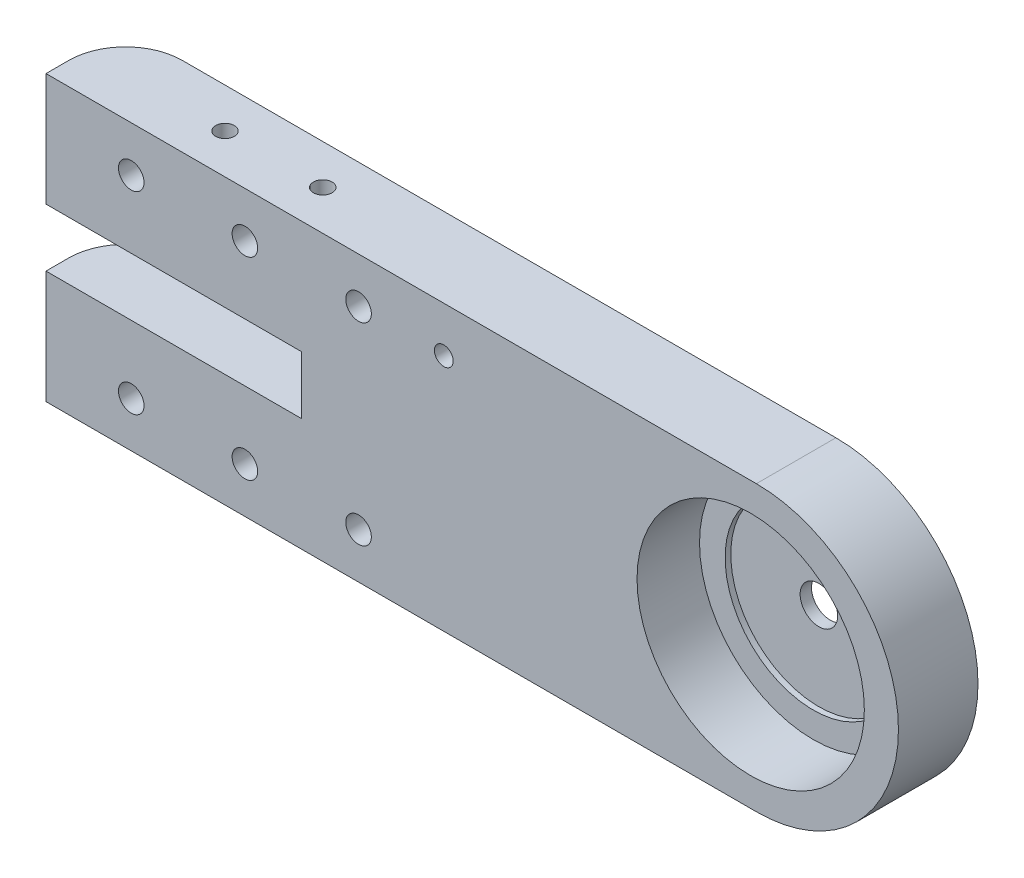
ISO-10303-21;
HEADER;
FILE_DESCRIPTION(('STEP AP214'),'2;1');
FILE_NAME('part.step','',(''),(''),'','','');
FILE_SCHEMA(('AUTOMOTIVE_DESIGN { 1 0 10303 214 1 1 1 1 }'));
ENDSEC;
DATA;
#1=APPLICATION_CONTEXT('core data for automotive mechanical design processes');
#2=APPLICATION_PROTOCOL_DEFINITION('international standard','automotive_design',2000,#1);
#3=PRODUCT_CONTEXT('',#1,'mechanical');
#4=PRODUCT('Part','Part','',(#3));
#5=PRODUCT_RELATED_PRODUCT_CATEGORY('part','',(#4));
#6=PRODUCT_DEFINITION_FORMATION('','',#4);
#7=PRODUCT_DEFINITION_CONTEXT('part definition',#1,'design');
#8=PRODUCT_DEFINITION('design','',#6,#7);
#9=PRODUCT_DEFINITION_SHAPE('','',#8);
#10=(LENGTH_UNIT() NAMED_UNIT(*) SI_UNIT(.MILLI.,.METRE.));
#11=(NAMED_UNIT(*) PLANE_ANGLE_UNIT() SI_UNIT($,.RADIAN.));
#12=(NAMED_UNIT(*) SI_UNIT($,.STERADIAN.) SOLID_ANGLE_UNIT());
#13=UNCERTAINTY_MEASURE_WITH_UNIT(LENGTH_MEASURE(1.E-05),#10,'distance_accuracy_value','');
#14=(GEOMETRIC_REPRESENTATION_CONTEXT(3) GLOBAL_UNCERTAINTY_ASSIGNED_CONTEXT((#13)) GLOBAL_UNIT_ASSIGNED_CONTEXT((#10,
#11,#12)) REPRESENTATION_CONTEXT('',''));
#15=CARTESIAN_POINT('',(0.,0.,0.));
#16=DIRECTION('',(0.,0.,1.));
#17=DIRECTION('',(1.,0.,0.));
#18=AXIS2_PLACEMENT_3D('',#15,#16,#17);
#19=CARTESIAN_POINT('',(0.,0.,0.));
#20=DIRECTION('',(-1.,0.,0.));
#21=DIRECTION('',(0.,-1.,0.));
#22=AXIS2_PLACEMENT_3D('',#19,#20,#21);
#23=PLANE('',#22);
#24=DIRECTION('',(0.,0.,-1.));
#25=VECTOR('',#24,1.);
#26=CARTESIAN_POINT('',(0.,-30.0999999994651,14.));
#27=LINE('',#26,#25);
#28=CARTESIAN_POINT('',(0.,-30.0999999994651,14.));
#29=VERTEX_POINT('',#28);
#30=CARTESIAN_POINT('',(0.,-30.0999999994651,10.));
#31=VERTEX_POINT('',#30);
#32=EDGE_CURVE('E109',#29,#31,#27,.T.);
#33=ORIENTED_EDGE('',*,*,#32,.T.);
#34=DIRECTION('',(0.,-1.,0.));
#35=VECTOR('',#34,1.);
#36=CARTESIAN_POINT('',(0.,-50.,10.));
#37=LINE('',#36,#35);
#38=CARTESIAN_POINT('',(0.,-50.,10.));
#39=VERTEX_POINT('',#38);
#40=EDGE_CURVE('E192',#31,#39,#37,.T.);
#41=ORIENTED_EDGE('',*,*,#40,.T.);
#42=DIRECTION('',(0.,0.,1.));
#43=VECTOR('',#42,1.);
#44=CARTESIAN_POINT('',(0.,-50.,0.));
#45=LINE('',#44,#43);
#46=CARTESIAN_POINT('',(0.,-50.,14.));
#47=VERTEX_POINT('',#46);
#48=EDGE_CURVE('E135',#39,#47,#45,.T.);
#49=ORIENTED_EDGE('',*,*,#48,.T.);
#50=DIRECTION('',(0.,-1.,0.));
#51=VECTOR('',#50,1.);
#52=CARTESIAN_POINT('',(0.,0.,14.));
#53=LINE('',#52,#51);
#54=EDGE_CURVE('E128',#29,#47,#53,.T.);
#55=ORIENTED_EDGE('',*,*,#54,.F.);
#56=EDGE_LOOP('',(#33,#41,#49,#55));
#57=FACE_BOUND('',#56,.T.);
#58=ADVANCED_FACE('F33',(#57),#23,.T.);
#59=CARTESIAN_POINT('',(125.,-25.,0.));
#60=DIRECTION('',(0.,0.,1.));
#61=DIRECTION('',(1.,0.,0.));
#62=AXIS2_PLACEMENT_3D('',#59,#60,#61);
#63=CYLINDRICAL_SURFACE('',#62,25.);
#64=CARTESIAN_POINT('',(125.,-25.,14.));
#65=DIRECTION('',(0.,0.,1.));
#66=DIRECTION('',(1.,0.,0.));
#67=AXIS2_PLACEMENT_3D('',#64,#65,#66);
#68=CIRCLE('',#67,25.);
#69=CARTESIAN_POINT('',(125.,-50.,14.));
#70=VERTEX_POINT('',#69);
#71=CARTESIAN_POINT('',(125.,0.,14.));
#72=VERTEX_POINT('',#71);
#73=EDGE_CURVE('E142',#70,#72,#68,.T.);
#74=ORIENTED_EDGE('',*,*,#73,.F.);
#75=DIRECTION('',(0.,0.,1.));
#76=VECTOR('',#75,1.);
#77=CARTESIAN_POINT('',(125.,-50.,0.));
#78=LINE('',#77,#76);
#79=CARTESIAN_POINT('',(125.,-50.,0.));
#80=VERTEX_POINT('',#79);
#81=EDGE_CURVE('E148',#80,#70,#78,.T.);
#82=ORIENTED_EDGE('',*,*,#81,.F.);
#83=CARTESIAN_POINT('',(125.,-25.,0.));
#84=DIRECTION('',(0.,0.,1.));
#85=DIRECTION('',(1.,0.,0.));
#86=AXIS2_PLACEMENT_3D('',#83,#84,#85);
#87=CIRCLE('',#86,25.);
#88=CARTESIAN_POINT('',(125.,0.,0.));
#89=VERTEX_POINT('',#88);
#90=EDGE_CURVE('E147',#80,#89,#87,.T.);
#91=ORIENTED_EDGE('',*,*,#90,.T.);
#92=DIRECTION('',(0.,0.,1.));
#93=VECTOR('',#92,1.);
#94=CARTESIAN_POINT('',(125.,0.,0.));
#95=LINE('',#94,#93);
#96=EDGE_CURVE('E154',#89,#72,#95,.T.);
#97=ORIENTED_EDGE('',*,*,#96,.T.);
#98=EDGE_LOOP('',(#74,#82,#91,#97));
#99=FACE_BOUND('',#98,.T.);
#100=ADVANCED_FACE('F317',(#99),#63,.T.);
#101=CARTESIAN_POINT('',(0.,-50.,0.));
#102=DIRECTION('',(0.,-1.,0.));
#103=DIRECTION('',(0.,0.,-1.));
#104=AXIS2_PLACEMENT_3D('',#101,#102,#103);
#105=PLANE('',#104);
#106=ORIENTED_EDGE('',*,*,#48,.F.);
#107=CARTESIAN_POINT('',(10.,-50.,10.));
#108=DIRECTION('',(0.,-1.,0.));
#109=DIRECTION('',(0.,0.,-1.));
#110=AXIS2_PLACEMENT_3D('',#107,#108,#109);
#111=CIRCLE('',#110,10.);
#112=CARTESIAN_POINT('',(10.,-50.,0.));
#113=VERTEX_POINT('',#112);
#114=EDGE_CURVE('E194',#39,#113,#111,.T.);
#115=ORIENTED_EDGE('',*,*,#114,.T.);
#116=DIRECTION('',(1.,0.,0.));
#117=VECTOR('',#116,1.);
#118=CARTESIAN_POINT('',(0.,-50.,0.));
#119=LINE('',#118,#117);
#120=EDGE_CURVE('E156',#113,#80,#119,.T.);
#121=ORIENTED_EDGE('',*,*,#120,.T.);
#122=ORIENTED_EDGE('',*,*,#81,.T.);
#123=DIRECTION('',(1.,0.,0.));
#124=VECTOR('',#123,1.);
#125=CARTESIAN_POINT('',(0.,-50.,14.));
#126=LINE('',#125,#124);
#127=EDGE_CURVE('E140',#47,#70,#126,.T.);
#128=ORIENTED_EDGE('',*,*,#127,.F.);
#129=EDGE_LOOP('',(#106,#115,#121,#122,#128));
#130=FACE_BOUND('',#129,.T.);
#131=ADVANCED_FACE('F322',(#130),#105,.T.);
#132=DIRECTION('',(0.,0.,1.));
#133=VECTOR('',#132,1.);
#134=CARTESIAN_POINT('',(0.,0.,0.));
#135=LINE('',#134,#133);
#136=CARTESIAN_POINT('',(0.,0.,10.));
#137=VERTEX_POINT('',#136);
#138=CARTESIAN_POINT('',(0.,0.,14.));
#139=VERTEX_POINT('',#138);
#140=EDGE_CURVE('E152',#137,#139,#135,.T.);
#141=ORIENTED_EDGE('',*,*,#140,.F.);
#142=DIRECTION('',(0.,-1.,0.));
#143=VECTOR('',#142,1.);
#144=CARTESIAN_POINT('',(0.,-19.8999999994651,10.));
#145=LINE('',#144,#143);
#146=CARTESIAN_POINT('',(0.,-19.8999999994651,10.));
#147=VERTEX_POINT('',#146);
#148=EDGE_CURVE('E201',#137,#147,#145,.T.);
#149=ORIENTED_EDGE('',*,*,#148,.T.);
#150=DIRECTION('',(0.,0.,-1.));
#151=VECTOR('',#150,1.);
#152=CARTESIAN_POINT('',(0.,-19.8999999994651,14.));
#153=LINE('',#152,#151);
#154=CARTESIAN_POINT('',(0.,-19.8999999994651,14.));
#155=VERTEX_POINT('',#154);
#156=EDGE_CURVE('E121',#155,#147,#153,.T.);
#157=ORIENTED_EDGE('',*,*,#156,.F.);
#158=EDGE_CURVE('E136',#139,#155,#53,.T.);
#159=ORIENTED_EDGE('',*,*,#158,.F.);
#160=EDGE_LOOP('',(#141,#149,#157,#159));
#161=FACE_BOUND('',#160,.T.);
#162=ADVANCED_FACE('F220',(#161),#23,.T.);
#163=CARTESIAN_POINT('',(125.,0.,0.));
#164=DIRECTION('',(0.,1.,0.));
#165=DIRECTION('',(0.,0.,1.));
#166=AXIS2_PLACEMENT_3D('',#163,#164,#165);
#167=PLANE('',#166);
#168=CARTESIAN_POINT('',(24.5,0.,7.00000000000001));
#169=DIRECTION('',(0.,1.,0.));
#170=DIRECTION('',(0.,0.,1.));
#171=AXIS2_PLACEMENT_3D('',#168,#169,#170);
#172=CIRCLE('',#171,1.64999999999998);
#173=CARTESIAN_POINT('',(24.5,0.,8.65));
#174=VERTEX_POINT('',#173);
#175=EDGE_CURVE('E276',#174,#174,#172,.T.);
#176=ORIENTED_EDGE('',*,*,#175,.F.);
#177=EDGE_LOOP('',(#176));
#178=FACE_BOUND('',#177,.T.);
#179=CARTESIAN_POINT('',(41.7,0.,7.00000000000001));
#180=DIRECTION('',(0.,1.,0.));
#181=DIRECTION('',(0.,0.,1.));
#182=AXIS2_PLACEMENT_3D('',#179,#180,#181);
#183=CIRCLE('',#182,1.64999999999998);
#184=CARTESIAN_POINT('',(41.7,0.,8.65));
#185=VERTEX_POINT('',#184);
#186=EDGE_CURVE('E270',#185,#185,#183,.T.);
#187=ORIENTED_EDGE('',*,*,#186,.F.);
#188=EDGE_LOOP('',(#187));
#189=FACE_BOUND('',#188,.T.);
#190=DIRECTION('',(-1.,0.,0.));
#191=VECTOR('',#190,1.);
#192=CARTESIAN_POINT('',(125.,0.,0.));
#193=LINE('',#192,#191);
#194=CARTESIAN_POINT('',(9.99999999999999,0.,0.));
#195=VERTEX_POINT('',#194);
#196=EDGE_CURVE('E233',#89,#195,#193,.T.);
#197=ORIENTED_EDGE('',*,*,#196,.T.);
#198=CARTESIAN_POINT('',(10.,0.,10.));
#199=DIRECTION('',(0.,1.,0.));
#200=DIRECTION('',(0.,0.,1.));
#201=AXIS2_PLACEMENT_3D('',#198,#199,#200);
#202=CIRCLE('',#201,10.);
#203=EDGE_CURVE('E11',#195,#137,#202,.T.);
#204=ORIENTED_EDGE('',*,*,#203,.T.);
#205=ORIENTED_EDGE('',*,*,#140,.T.);
#206=DIRECTION('',(-1.,0.,0.));
#207=VECTOR('',#206,1.);
#208=CARTESIAN_POINT('',(125.,0.,14.));
#209=LINE('',#208,#207);
#210=EDGE_CURVE('E137',#72,#139,#209,.T.);
#211=ORIENTED_EDGE('',*,*,#210,.F.);
#212=ORIENTED_EDGE('',*,*,#96,.F.);
#213=EDGE_LOOP('',(#197,#204,#205,#211,#212));
#214=FACE_BOUND('',#213,.T.);
#215=ADVANCED_FACE('F223',(#178,#189,#214),#167,.T.);
#216=CARTESIAN_POINT('',(125.,-25.,0.));
#217=DIRECTION('',(0.,0.,1.));
#218=DIRECTION('',(1.,0.,0.));
#219=AXIS2_PLACEMENT_3D('',#216,#217,#218);
#220=PLANE('',#219);
#221=CARTESIAN_POINT('',(55.,-42.,0.));
#222=DIRECTION('',(0.,0.,1.));
#223=DIRECTION('',(1.,0.,0.));
#224=AXIS2_PLACEMENT_3D('',#221,#222,#223);
#225=CIRCLE('',#224,4.70000000000689);
#226=CARTESIAN_POINT('',(59.7000000000069,-42.,0.));
#227=VERTEX_POINT('',#226);
#228=EDGE_CURVE('E174',#227,#227,#225,.T.);
#229=ORIENTED_EDGE('',*,*,#228,.T.);
#230=EDGE_LOOP('',(#229));
#231=FACE_BOUND('',#230,.T.);
#232=CARTESIAN_POINT('',(55.,-8.00000000000001,0.));
#233=DIRECTION('',(0.,0.,1.));
#234=DIRECTION('',(1.,0.,0.));
#235=AXIS2_PLACEMENT_3D('',#232,#233,#234);
#236=CIRCLE('',#235,4.70000000000689);
#237=CARTESIAN_POINT('',(59.7000000000069,-8.00000000000001,0.));
#238=VERTEX_POINT('',#237);
#239=EDGE_CURVE('E171',#238,#238,#236,.T.);
#240=ORIENTED_EDGE('',*,*,#239,.T.);
#241=EDGE_LOOP('',(#240));
#242=FACE_BOUND('',#241,.T.);
#243=CARTESIAN_POINT('',(15.,-42.,0.));
#244=DIRECTION('',(0.,0.,1.));
#245=DIRECTION('',(1.,0.,0.));
#246=AXIS2_PLACEMENT_3D('',#243,#244,#245);
#247=CIRCLE('',#246,4.70000000000689);
#248=CARTESIAN_POINT('',(19.7000000000069,-42.,0.));
#249=VERTEX_POINT('',#248);
#250=EDGE_CURVE('E168',#249,#249,#247,.T.);
#251=ORIENTED_EDGE('',*,*,#250,.T.);
#252=EDGE_LOOP('',(#251));
#253=FACE_BOUND('',#252,.T.);
#254=CARTESIAN_POINT('',(35.,-42.,0.));
#255=DIRECTION('',(0.,0.,1.));
#256=DIRECTION('',(1.,0.,0.));
#257=AXIS2_PLACEMENT_3D('',#254,#255,#256);
#258=CIRCLE('',#257,4.70000000000689);
#259=CARTESIAN_POINT('',(39.7000000000069,-42.,0.));
#260=VERTEX_POINT('',#259);
#261=EDGE_CURVE('E165',#260,#260,#258,.T.);
#262=ORIENTED_EDGE('',*,*,#261,.T.);
#263=EDGE_LOOP('',(#262));
#264=FACE_BOUND('',#263,.T.);
#265=CARTESIAN_POINT('',(15.,-8.,0.));
#266=DIRECTION('',(0.,0.,1.));
#267=DIRECTION('',(1.,0.,0.));
#268=AXIS2_PLACEMENT_3D('',#265,#266,#267);
#269=CIRCLE('',#268,4.70000000000689);
#270=CARTESIAN_POINT('',(19.7000000000069,-8.,0.));
#271=VERTEX_POINT('',#270);
#272=EDGE_CURVE('E162',#271,#271,#269,.T.);
#273=ORIENTED_EDGE('',*,*,#272,.T.);
#274=EDGE_LOOP('',(#273));
#275=FACE_BOUND('',#274,.T.);
#276=CARTESIAN_POINT('',(35.,-8.,0.));
#277=DIRECTION('',(0.,0.,1.));
#278=DIRECTION('',(1.,0.,0.));
#279=AXIS2_PLACEMENT_3D('',#276,#277,#278);
#280=CIRCLE('',#279,4.70000000000689);
#281=CARTESIAN_POINT('',(39.7000000000069,-8.,0.));
#282=VERTEX_POINT('',#281);
#283=EDGE_CURVE('E159',#282,#282,#280,.T.);
#284=ORIENTED_EDGE('',*,*,#283,.T.);
#285=EDGE_LOOP('',(#284));
#286=FACE_BOUND('',#285,.T.);
#287=CARTESIAN_POINT('',(70.,-8.,0.));
#288=DIRECTION('',(0.,0.,-1.));
#289=DIRECTION('',(-1.,0.,0.));
#290=AXIS2_PLACEMENT_3D('',#287,#288,#289);
#291=CIRCLE('',#290,1.64999999999998);
#292=CARTESIAN_POINT('',(68.35,-8.,0.));
#293=VERTEX_POINT('',#292);
#294=EDGE_CURVE('E264',#293,#293,#291,.T.);
#295=ORIENTED_EDGE('',*,*,#294,.F.);
#296=EDGE_LOOP('',(#295));
#297=FACE_BOUND('',#296,.T.);
#298=CARTESIAN_POINT('',(123.999999994871,-24.9999999994651,0.));
#299=DIRECTION('',(0.,0.,1.));
#300=DIRECTION('',(1.,0.,0.));
#301=AXIS2_PLACEMENT_3D('',#298,#299,#300);
#302=CIRCLE('',#301,3.30000000474603);
#303=CARTESIAN_POINT('',(127.299999999617,-24.9999999994651,0.));
#304=VERTEX_POINT('',#303);
#305=EDGE_CURVE('E241',#304,#304,#302,.T.);
#306=ORIENTED_EDGE('',*,*,#305,.T.);
#307=EDGE_LOOP('',(#306));
#308=FACE_BOUND('',#307,.T.);
#309=ORIENTED_EDGE('',*,*,#120,.F.);
#310=DIRECTION('',(0.,-1.,0.));
#311=VECTOR('',#310,1.);
#312=CARTESIAN_POINT('',(10.,-30.0999999994651,0.));
#313=LINE('',#312,#311);
#314=CARTESIAN_POINT('',(10.,-30.0999999994651,0.));
#315=VERTEX_POINT('',#314);
#316=EDGE_CURVE('E198',#113,#315,#313,.F.);
#317=ORIENTED_EDGE('',*,*,#316,.T.);
#318=DIRECTION('',(-1.,0.,0.));
#319=VECTOR('',#318,1.);
#320=CARTESIAN_POINT('',(45.,-30.0999999994651,0.));
#321=LINE('',#320,#319);
#322=CARTESIAN_POINT('',(45.,-30.0999999994651,0.));
#323=VERTEX_POINT('',#322);
#324=EDGE_CURVE('E217',#323,#315,#321,.T.);
#325=ORIENTED_EDGE('',*,*,#324,.F.);
#326=DIRECTION('',(0.,-1.,0.));
#327=VECTOR('',#326,1.);
#328=CARTESIAN_POINT('',(45.,-19.8999999994651,0.));
#329=LINE('',#328,#327);
#330=CARTESIAN_POINT('',(45.,-19.8999999994651,0.));
#331=VERTEX_POINT('',#330);
#332=EDGE_CURVE('E132',#331,#323,#329,.T.);
#333=ORIENTED_EDGE('',*,*,#332,.F.);
#334=DIRECTION('',(1.,0.,0.));
#335=VECTOR('',#334,1.);
#336=CARTESIAN_POINT('',(0.,-19.8999999994651,0.));
#337=LINE('',#336,#335);
#338=CARTESIAN_POINT('',(10.,-19.8999999994651,0.));
#339=VERTEX_POINT('',#338);
#340=EDGE_CURVE('E207',#339,#331,#337,.T.);
#341=ORIENTED_EDGE('',*,*,#340,.F.);
#342=DIRECTION('',(0.,-1.,0.));
#343=VECTOR('',#342,1.);
#344=CARTESIAN_POINT('',(10.,0.,0.));
#345=LINE('',#344,#343);
#346=EDGE_CURVE('E196',#339,#195,#345,.F.);
#347=ORIENTED_EDGE('',*,*,#346,.T.);
#348=ORIENTED_EDGE('',*,*,#196,.F.);
#349=ORIENTED_EDGE('',*,*,#90,.F.);
#350=EDGE_LOOP('',(#309,#317,#325,#333,#341,#347,#348,#349));
#351=FACE_BOUND('',#350,.T.);
#352=ADVANCED_FACE('F213',(#231,#242,#253,#264,#275,#286,#297,#308,#351),#220,.F.);
#353=CARTESIAN_POINT('',(125.,-25.,14.));
#354=DIRECTION('',(0.,0.,1.));
#355=DIRECTION('',(1.,0.,0.));
#356=AXIS2_PLACEMENT_3D('',#353,#354,#355);
#357=PLANE('',#356);
#358=CARTESIAN_POINT('',(15.,-8.,14.));
#359=DIRECTION('',(0.,0.,-1.));
#360=DIRECTION('',(-1.,0.,0.));
#361=AXIS2_PLACEMENT_3D('',#358,#359,#360);
#362=CIRCLE('',#361,2.24999999999998);
#363=CARTESIAN_POINT('',(12.75,-8.,14.));
#364=VERTEX_POINT('',#363);
#365=EDGE_CURVE('E294',#364,#364,#362,.T.);
#366=ORIENTED_EDGE('',*,*,#365,.T.);
#367=EDGE_LOOP('',(#366));
#368=FACE_BOUND('',#367,.T.);
#369=CARTESIAN_POINT('',(15.,-42.,14.));
#370=DIRECTION('',(0.,0.,-1.));
#371=DIRECTION('',(-1.,0.,0.));
#372=AXIS2_PLACEMENT_3D('',#369,#370,#371);
#373=CIRCLE('',#372,2.24999999999998);
#374=CARTESIAN_POINT('',(12.75,-42.,14.));
#375=VERTEX_POINT('',#374);
#376=EDGE_CURVE('E291',#375,#375,#373,.T.);
#377=ORIENTED_EDGE('',*,*,#376,.T.);
#378=EDGE_LOOP('',(#377));
#379=FACE_BOUND('',#378,.T.);
#380=CARTESIAN_POINT('',(35.,-42.,14.));
#381=DIRECTION('',(0.,0.,-1.));
#382=DIRECTION('',(-1.,0.,0.));
#383=AXIS2_PLACEMENT_3D('',#380,#381,#382);
#384=CIRCLE('',#383,2.24999999999998);
#385=CARTESIAN_POINT('',(32.75,-42.,14.));
#386=VERTEX_POINT('',#385);
#387=EDGE_CURVE('E288',#386,#386,#384,.T.);
#388=ORIENTED_EDGE('',*,*,#387,.T.);
#389=EDGE_LOOP('',(#388));
#390=FACE_BOUND('',#389,.T.);
#391=CARTESIAN_POINT('',(35.,-8.,14.));
#392=DIRECTION('',(0.,0.,-1.));
#393=DIRECTION('',(-1.,0.,0.));
#394=AXIS2_PLACEMENT_3D('',#391,#392,#393);
#395=CIRCLE('',#394,2.24999999999998);
#396=CARTESIAN_POINT('',(32.75,-8.,14.));
#397=VERTEX_POINT('',#396);
#398=EDGE_CURVE('E285',#397,#397,#395,.T.);
#399=ORIENTED_EDGE('',*,*,#398,.T.);
#400=EDGE_LOOP('',(#399));
#401=FACE_BOUND('',#400,.T.);
#402=CARTESIAN_POINT('',(55.,-8.00000000000001,14.));
#403=DIRECTION('',(0.,0.,-1.));
#404=DIRECTION('',(-1.,0.,0.));
#405=AXIS2_PLACEMENT_3D('',#402,#403,#404);
#406=CIRCLE('',#405,2.24999999999998);
#407=CARTESIAN_POINT('',(52.75,-8.00000000000001,14.));
#408=VERTEX_POINT('',#407);
#409=EDGE_CURVE('E282',#408,#408,#406,.T.);
#410=ORIENTED_EDGE('',*,*,#409,.T.);
#411=EDGE_LOOP('',(#410));
#412=FACE_BOUND('',#411,.T.);
#413=CARTESIAN_POINT('',(55.,-42.,14.));
#414=DIRECTION('',(0.,0.,-1.));
#415=DIRECTION('',(-1.,0.,0.));
#416=AXIS2_PLACEMENT_3D('',#413,#414,#415);
#417=CIRCLE('',#416,2.24999999999998);
#418=CARTESIAN_POINT('',(52.75,-42.,14.));
#419=VERTEX_POINT('',#418);
#420=EDGE_CURVE('E279',#419,#419,#417,.T.);
#421=ORIENTED_EDGE('',*,*,#420,.T.);
#422=EDGE_LOOP('',(#421));
#423=FACE_BOUND('',#422,.T.);
#424=CARTESIAN_POINT('',(70.,-8.,14.));
#425=DIRECTION('',(0.,0.,-1.));
#426=DIRECTION('',(-1.,0.,0.));
#427=AXIS2_PLACEMENT_3D('',#424,#425,#426);
#428=CIRCLE('',#427,1.64999999999998);
#429=CARTESIAN_POINT('',(68.35,-8.,14.));
#430=VERTEX_POINT('',#429);
#431=EDGE_CURVE('E261',#430,#430,#428,.T.);
#432=ORIENTED_EDGE('',*,*,#431,.T.);
#433=EDGE_LOOP('',(#432));
#434=FACE_BOUND('',#433,.T.);
#435=CARTESIAN_POINT('',(123.999999994871,-24.9999999994651,14.));
#436=DIRECTION('',(0.,0.,1.));
#437=DIRECTION('',(1.,0.,0.));
#438=AXIS2_PLACEMENT_3D('',#435,#436,#437);
#439=CIRCLE('',#438,20.0000000051291);
#440=CARTESIAN_POINT('',(144.,-24.9999999994651,14.));
#441=VERTEX_POINT('',#440);
#442=EDGE_CURVE('E246',#441,#441,#439,.T.);
#443=ORIENTED_EDGE('',*,*,#442,.F.);
#444=EDGE_LOOP('',(#443));
#445=FACE_BOUND('',#444,.T.);
#446=DIRECTION('',(-1.,0.,0.));
#447=VECTOR('',#446,1.);
#448=CARTESIAN_POINT('',(45.,-30.0999999994651,14.));
#449=LINE('',#448,#447);
#450=CARTESIAN_POINT('',(45.,-30.0999999994651,14.));
#451=VERTEX_POINT('',#450);
#452=EDGE_CURVE('E113',#451,#29,#449,.T.);
#453=ORIENTED_EDGE('',*,*,#452,.T.);
#454=ORIENTED_EDGE('',*,*,#54,.T.);
#455=ORIENTED_EDGE('',*,*,#127,.T.);
#456=ORIENTED_EDGE('',*,*,#73,.T.);
#457=ORIENTED_EDGE('',*,*,#210,.T.);
#458=ORIENTED_EDGE('',*,*,#158,.T.);
#459=DIRECTION('',(1.,0.,0.));
#460=VECTOR('',#459,1.);
#461=CARTESIAN_POINT('',(0.,-19.8999999994651,14.));
#462=LINE('',#461,#460);
#463=CARTESIAN_POINT('',(45.,-19.8999999994651,14.));
#464=VERTEX_POINT('',#463);
#465=EDGE_CURVE('E131',#155,#464,#462,.T.);
#466=ORIENTED_EDGE('',*,*,#465,.T.);
#467=DIRECTION('',(0.,-1.,0.));
#468=VECTOR('',#467,1.);
#469=CARTESIAN_POINT('',(45.,-19.8999999994651,14.));
#470=LINE('',#469,#468);
#471=EDGE_CURVE('E122',#464,#451,#470,.T.);
#472=ORIENTED_EDGE('',*,*,#471,.T.);
#473=EDGE_LOOP('',(#453,#454,#455,#456,#457,#458,#466,#472));
#474=FACE_BOUND('',#473,.T.);
#475=ADVANCED_FACE('F126',(#368,#379,#390,#401,#412,#423,#434,#445,#474),#357,.T.);
#476=CARTESIAN_POINT('',(45.,-30.0999999994651,14.));
#477=DIRECTION('',(0.,-1.,0.));
#478=DIRECTION('',(0.,0.,-1.));
#479=AXIS2_PLACEMENT_3D('',#476,#477,#478);
#480=PLANE('',#479);
#481=ORIENTED_EDGE('',*,*,#324,.T.);
#482=CARTESIAN_POINT('',(10.,-30.0999999994651,10.));
#483=DIRECTION('',(0.,-1.,0.));
#484=DIRECTION('',(0.,0.,-1.));
#485=AXIS2_PLACEMENT_3D('',#482,#483,#484);
#486=CIRCLE('',#485,10.);
#487=EDGE_CURVE('E116',#315,#31,#486,.F.);
#488=ORIENTED_EDGE('',*,*,#487,.T.);
#489=ORIENTED_EDGE('',*,*,#32,.F.);
#490=ORIENTED_EDGE('',*,*,#452,.F.);
#491=DIRECTION('',(0.,0.,-1.));
#492=VECTOR('',#491,1.);
#493=CARTESIAN_POINT('',(45.,-30.0999999994651,14.));
#494=LINE('',#493,#492);
#495=EDGE_CURVE('E228',#451,#323,#494,.T.);
#496=ORIENTED_EDGE('',*,*,#495,.T.);
#497=EDGE_LOOP('',(#481,#488,#489,#490,#496));
#498=FACE_BOUND('',#497,.T.);
#499=ADVANCED_FACE('F112',(#498),#480,.F.);
#500=CARTESIAN_POINT('',(45.,-19.8999999994651,14.));
#501=DIRECTION('',(1.,0.,0.));
#502=DIRECTION('',(0.,0.,-1.));
#503=AXIS2_PLACEMENT_3D('',#500,#501,#502);
#504=PLANE('',#503);
#505=ORIENTED_EDGE('',*,*,#332,.T.);
#506=ORIENTED_EDGE('',*,*,#495,.F.);
#507=ORIENTED_EDGE('',*,*,#471,.F.);
#508=DIRECTION('',(0.,0.,-1.));
#509=VECTOR('',#508,1.);
#510=CARTESIAN_POINT('',(45.,-19.8999999994651,14.));
#511=LINE('',#510,#509);
#512=EDGE_CURVE('E229',#464,#331,#511,.T.);
#513=ORIENTED_EDGE('',*,*,#512,.T.);
#514=EDGE_LOOP('',(#505,#506,#507,#513));
#515=FACE_BOUND('',#514,.T.);
#516=ADVANCED_FACE('F343',(#515),#504,.F.);
#517=CARTESIAN_POINT('',(0.,-19.8999999994651,14.));
#518=DIRECTION('',(0.,1.,0.));
#519=DIRECTION('',(0.,0.,1.));
#520=AXIS2_PLACEMENT_3D('',#517,#518,#519);
#521=PLANE('',#520);
#522=CARTESIAN_POINT('',(24.5,-19.8999999994651,7.00000000000001));
#523=DIRECTION('',(0.,1.,0.));
#524=DIRECTION('',(0.,0.,1.));
#525=AXIS2_PLACEMENT_3D('',#522,#523,#524);
#526=CIRCLE('',#525,1.64999999999999);
#527=CARTESIAN_POINT('',(24.5,-19.8999999994651,8.65));
#528=VERTEX_POINT('',#527);
#529=EDGE_CURVE('E273',#528,#528,#526,.T.);
#530=ORIENTED_EDGE('',*,*,#529,.T.);
#531=EDGE_LOOP('',(#530));
#532=FACE_BOUND('',#531,.T.);
#533=CARTESIAN_POINT('',(41.7,-19.8999999994651,7.00000000000001));
#534=DIRECTION('',(0.,1.,0.));
#535=DIRECTION('',(0.,0.,1.));
#536=AXIS2_PLACEMENT_3D('',#533,#534,#535);
#537=CIRCLE('',#536,1.64999999999999);
#538=CARTESIAN_POINT('',(41.7,-19.8999999994651,8.65));
#539=VERTEX_POINT('',#538);
#540=EDGE_CURVE('E267',#539,#539,#537,.T.);
#541=ORIENTED_EDGE('',*,*,#540,.T.);
#542=EDGE_LOOP('',(#541));
#543=FACE_BOUND('',#542,.T.);
#544=ORIENTED_EDGE('',*,*,#156,.T.);
#545=CARTESIAN_POINT('',(10.,-19.8999999994651,10.));
#546=DIRECTION('',(0.,1.,0.));
#547=DIRECTION('',(0.,0.,1.));
#548=AXIS2_PLACEMENT_3D('',#545,#546,#547);
#549=CIRCLE('',#548,10.);
#550=EDGE_CURVE('E41',#147,#339,#549,.F.);
#551=ORIENTED_EDGE('',*,*,#550,.T.);
#552=ORIENTED_EDGE('',*,*,#340,.T.);
#553=ORIENTED_EDGE('',*,*,#512,.F.);
#554=ORIENTED_EDGE('',*,*,#465,.F.);
#555=EDGE_LOOP('',(#544,#551,#552,#553,#554));
#556=FACE_BOUND('',#555,.T.);
#557=ADVANCED_FACE('F205',(#532,#543,#556),#521,.F.);
#558=CARTESIAN_POINT('',(123.999999994871,-24.9999999994651,0.));
#559=DIRECTION('',(0.,0.,1.));
#560=DIRECTION('',(1.,0.,0.));
#561=AXIS2_PLACEMENT_3D('',#558,#559,#560);
#562=CYLINDRICAL_SURFACE('',#561,3.30000000474603);
#563=ORIENTED_EDGE('',*,*,#305,.F.);
#564=EDGE_LOOP('',(#563));
#565=FACE_BOUND('',#564,.T.);
#566=CARTESIAN_POINT('',(123.999999994871,-24.9999999994651,2.));
#567=DIRECTION('',(0.,0.,1.));
#568=DIRECTION('',(1.,0.,0.));
#569=AXIS2_PLACEMENT_3D('',#566,#567,#568);
#570=CIRCLE('',#569,3.30000000474603);
#571=CARTESIAN_POINT('',(127.299999999617,-24.9999999994651,2.));
#572=VERTEX_POINT('',#571);
#573=EDGE_CURVE('E258',#572,#572,#570,.T.);
#574=ORIENTED_EDGE('',*,*,#573,.T.);
#575=EDGE_LOOP('',(#574));
#576=FACE_BOUND('',#575,.T.);
#577=ADVANCED_FACE('F346',(#565,#576),#562,.F.);
#578=CARTESIAN_POINT('',(123.999999994871,-24.9999999994651,0.));
#579=DIRECTION('',(0.,0.,1.));
#580=DIRECTION('',(1.,0.,0.));
#581=AXIS2_PLACEMENT_3D('',#578,#579,#580);
#582=CYLINDRICAL_SURFACE('',#581,20.0000000051291);
#583=CARTESIAN_POINT('',(123.999999994871,-24.9999999994651,3.));
#584=DIRECTION('',(0.,0.,1.));
#585=DIRECTION('',(1.,0.,0.));
#586=AXIS2_PLACEMENT_3D('',#583,#584,#585);
#587=CIRCLE('',#586,20.0000000051291);
#588=CARTESIAN_POINT('',(144.,-24.9999999994651,3.));
#589=VERTEX_POINT('',#588);
#590=EDGE_CURVE('E249',#589,#589,#587,.T.);
#591=ORIENTED_EDGE('',*,*,#590,.F.);
#592=EDGE_LOOP('',(#591));
#593=FACE_BOUND('',#592,.T.);
#594=ORIENTED_EDGE('',*,*,#442,.T.);
#595=EDGE_LOOP('',(#594));
#596=FACE_BOUND('',#595,.T.);
#597=ADVANCED_FACE('F353',(#593,#596),#582,.F.);
#598=CARTESIAN_POINT('',(144.,-24.9999999994651,3.));
#599=DIRECTION('',(0.,0.,-1.));
#600=DIRECTION('',(-1.,0.,0.));
#601=AXIS2_PLACEMENT_3D('',#598,#599,#600);
#602=PLANE('',#601);
#603=CARTESIAN_POINT('',(123.999999994871,-24.9999999994651,3.));
#604=DIRECTION('',(0.,0.,1.));
#605=DIRECTION('',(1.,0.,0.));
#606=AXIS2_PLACEMENT_3D('',#603,#604,#605);
#607=CIRCLE('',#606,15.500000004746);
#608=CARTESIAN_POINT('',(139.499999999617,-24.9999999994651,3.));
#609=VERTEX_POINT('',#608);
#610=EDGE_CURVE('E252',#609,#609,#607,.T.);
#611=ORIENTED_EDGE('',*,*,#610,.F.);
#612=EDGE_LOOP('',(#611));
#613=FACE_BOUND('',#612,.T.);
#614=ORIENTED_EDGE('',*,*,#590,.T.);
#615=EDGE_LOOP('',(#614));
#616=FACE_BOUND('',#615,.T.);
#617=ADVANCED_FACE('F357',(#613,#616),#602,.F.);
#618=CARTESIAN_POINT('',(123.999999994871,-24.9999999994651,0.));
#619=DIRECTION('',(0.,0.,1.));
#620=DIRECTION('',(1.,0.,0.));
#621=AXIS2_PLACEMENT_3D('',#618,#619,#620);
#622=CYLINDRICAL_SURFACE('',#621,15.500000004746);
#623=CARTESIAN_POINT('',(123.999999994871,-24.9999999994651,2.));
#624=DIRECTION('',(0.,0.,1.));
#625=DIRECTION('',(1.,0.,0.));
#626=AXIS2_PLACEMENT_3D('',#623,#624,#625);
#627=CIRCLE('',#626,15.500000004746);
#628=CARTESIAN_POINT('',(139.499999999617,-24.9999999994651,2.));
#629=VERTEX_POINT('',#628);
#630=EDGE_CURVE('E255',#629,#629,#627,.T.);
#631=ORIENTED_EDGE('',*,*,#630,.F.);
#632=EDGE_LOOP('',(#631));
#633=FACE_BOUND('',#632,.T.);
#634=ORIENTED_EDGE('',*,*,#610,.T.);
#635=EDGE_LOOP('',(#634));
#636=FACE_BOUND('',#635,.T.);
#637=ADVANCED_FACE('F361',(#633,#636),#622,.F.);
#638=CARTESIAN_POINT('',(139.499999999617,-24.9999999994651,2.));
#639=DIRECTION('',(0.,0.,-1.));
#640=DIRECTION('',(-1.,0.,0.));
#641=AXIS2_PLACEMENT_3D('',#638,#639,#640);
#642=PLANE('',#641);
#643=ORIENTED_EDGE('',*,*,#573,.F.);
#644=EDGE_LOOP('',(#643));
#645=FACE_BOUND('',#644,.T.);
#646=ORIENTED_EDGE('',*,*,#630,.T.);
#647=EDGE_LOOP('',(#646));
#648=FACE_BOUND('',#647,.T.);
#649=ADVANCED_FACE('F365',(#645,#648),#642,.F.);
#650=CARTESIAN_POINT('',(70.,-8.,0.));
#651=DIRECTION('',(0.,0.,-1.));
#652=DIRECTION('',(-1.,0.,0.));
#653=AXIS2_PLACEMENT_3D('',#650,#651,#652);
#654=CYLINDRICAL_SURFACE('',#653,1.64999999999998);
#655=ORIENTED_EDGE('',*,*,#431,.F.);
#656=EDGE_LOOP('',(#655));
#657=FACE_BOUND('',#656,.T.);
#658=ORIENTED_EDGE('',*,*,#294,.T.);
#659=EDGE_LOOP('',(#658));
#660=FACE_BOUND('',#659,.T.);
#661=ADVANCED_FACE('F369',(#657,#660),#654,.F.);
#662=CARTESIAN_POINT('',(41.7,0.,7.00000000000001));
#663=DIRECTION('',(0.,1.,0.));
#664=DIRECTION('',(0.,0.,1.));
#665=AXIS2_PLACEMENT_3D('',#662,#663,#664);
#666=CYLINDRICAL_SURFACE('',#665,1.64999999999999);
#667=ORIENTED_EDGE('',*,*,#540,.F.);
#668=EDGE_LOOP('',(#667));
#669=FACE_BOUND('',#668,.T.);
#670=ORIENTED_EDGE('',*,*,#186,.T.);
#671=EDGE_LOOP('',(#670));
#672=FACE_BOUND('',#671,.T.);
#673=ADVANCED_FACE('F373',(#669,#672),#666,.F.);
#674=CARTESIAN_POINT('',(24.5,0.,7.00000000000001));
#675=DIRECTION('',(0.,1.,0.));
#676=DIRECTION('',(0.,0.,1.));
#677=AXIS2_PLACEMENT_3D('',#674,#675,#676);
#678=CYLINDRICAL_SURFACE('',#677,1.64999999999999);
#679=ORIENTED_EDGE('',*,*,#529,.F.);
#680=EDGE_LOOP('',(#679));
#681=FACE_BOUND('',#680,.T.);
#682=ORIENTED_EDGE('',*,*,#175,.T.);
#683=EDGE_LOOP('',(#682));
#684=FACE_BOUND('',#683,.T.);
#685=ADVANCED_FACE('F377',(#681,#684),#678,.F.);
#686=CARTESIAN_POINT('',(55.,-42.,0.));
#687=DIRECTION('',(0.,0.,-1.));
#688=DIRECTION('',(-1.,0.,0.));
#689=AXIS2_PLACEMENT_3D('',#686,#687,#688);
#690=CYLINDRICAL_SURFACE('',#689,2.24999999999998);
#691=CARTESIAN_POINT('',(55.,-42.,2.44999999995005));
#692=DIRECTION('',(0.,0.,1.));
#693=DIRECTION('',(1.,0.,0.));
#694=AXIS2_PLACEMENT_3D('',#691,#692,#693);
#695=CIRCLE('',#694,2.24999999999998);
#696=CARTESIAN_POINT('',(57.25,-42.,2.44999999995005));
#697=VERTEX_POINT('',#696);
#698=EDGE_CURVE('E150',#697,#697,#695,.F.);
#699=ORIENTED_EDGE('',*,*,#698,.T.);
#700=EDGE_LOOP('',(#699));
#701=FACE_BOUND('',#700,.T.);
#702=ORIENTED_EDGE('',*,*,#420,.F.);
#703=EDGE_LOOP('',(#702));
#704=FACE_BOUND('',#703,.T.);
#705=ADVANCED_FACE('F381',(#701,#704),#690,.F.);
#706=CARTESIAN_POINT('',(55.,-8.00000000000001,0.));
#707=DIRECTION('',(0.,0.,-1.));
#708=DIRECTION('',(-1.,0.,0.));
#709=AXIS2_PLACEMENT_3D('',#706,#707,#708);
#710=CYLINDRICAL_SURFACE('',#709,2.24999999999998);
#711=CARTESIAN_POINT('',(55.,-8.00000000000001,2.44999999995005));
#712=DIRECTION('',(0.,0.,1.));
#713=DIRECTION('',(1.,0.,0.));
#714=AXIS2_PLACEMENT_3D('',#711,#712,#713);
#715=CIRCLE('',#714,2.24999999999998);
#716=CARTESIAN_POINT('',(57.25,-8.00000000000001,2.44999999995005));
#717=VERTEX_POINT('',#716);
#718=EDGE_CURVE('E177',#717,#717,#715,.F.);
#719=ORIENTED_EDGE('',*,*,#718,.T.);
#720=EDGE_LOOP('',(#719));
#721=FACE_BOUND('',#720,.T.);
#722=ORIENTED_EDGE('',*,*,#409,.F.);
#723=EDGE_LOOP('',(#722));
#724=FACE_BOUND('',#723,.T.);
#725=ADVANCED_FACE('F385',(#721,#724),#710,.F.);
#726=CARTESIAN_POINT('',(35.,-8.,0.));
#727=DIRECTION('',(0.,0.,-1.));
#728=DIRECTION('',(-1.,0.,0.));
#729=AXIS2_PLACEMENT_3D('',#726,#727,#728);
#730=CYLINDRICAL_SURFACE('',#729,2.24999999999998);
#731=CARTESIAN_POINT('',(35.,-8.,2.44999999995005));
#732=DIRECTION('',(0.,0.,1.));
#733=DIRECTION('',(1.,0.,0.));
#734=AXIS2_PLACEMENT_3D('',#731,#732,#733);
#735=CIRCLE('',#734,2.24999999999998);
#736=CARTESIAN_POINT('',(37.25,-8.,2.44999999995005));
#737=VERTEX_POINT('',#736);
#738=EDGE_CURVE('E189',#737,#737,#735,.F.);
#739=ORIENTED_EDGE('',*,*,#738,.T.);
#740=EDGE_LOOP('',(#739));
#741=FACE_BOUND('',#740,.T.);
#742=ORIENTED_EDGE('',*,*,#398,.F.);
#743=EDGE_LOOP('',(#742));
#744=FACE_BOUND('',#743,.T.);
#745=ADVANCED_FACE('F389',(#741,#744),#730,.F.);
#746=CARTESIAN_POINT('',(35.,-42.,0.));
#747=DIRECTION('',(0.,0.,-1.));
#748=DIRECTION('',(-1.,0.,0.));
#749=AXIS2_PLACEMENT_3D('',#746,#747,#748);
#750=CYLINDRICAL_SURFACE('',#749,2.24999999999998);
#751=CARTESIAN_POINT('',(35.,-42.,2.44999999995005));
#752=DIRECTION('',(0.,0.,1.));
#753=DIRECTION('',(1.,0.,0.));
#754=AXIS2_PLACEMENT_3D('',#751,#752,#753);
#755=CIRCLE('',#754,2.24999999999998);
#756=CARTESIAN_POINT('',(37.25,-42.,2.44999999995005));
#757=VERTEX_POINT('',#756);
#758=EDGE_CURVE('E183',#757,#757,#755,.F.);
#759=ORIENTED_EDGE('',*,*,#758,.T.);
#760=EDGE_LOOP('',(#759));
#761=FACE_BOUND('',#760,.T.);
#762=ORIENTED_EDGE('',*,*,#387,.F.);
#763=EDGE_LOOP('',(#762));
#764=FACE_BOUND('',#763,.T.);
#765=ADVANCED_FACE('F313',(#761,#764),#750,.F.);
#766=CARTESIAN_POINT('',(15.,-42.,0.));
#767=DIRECTION('',(0.,0.,-1.));
#768=DIRECTION('',(-1.,0.,0.));
#769=AXIS2_PLACEMENT_3D('',#766,#767,#768);
#770=CYLINDRICAL_SURFACE('',#769,2.24999999999998);
#771=CARTESIAN_POINT('',(15.,-42.,2.44999999995006));
#772=DIRECTION('',(0.,0.,1.));
#773=DIRECTION('',(1.,0.,0.));
#774=AXIS2_PLACEMENT_3D('',#771,#772,#773);
#775=CIRCLE('',#774,2.24999999999998);
#776=CARTESIAN_POINT('',(17.25,-42.,2.44999999995006));
#777=VERTEX_POINT('',#776);
#778=EDGE_CURVE('E180',#777,#777,#775,.F.);
#779=ORIENTED_EDGE('',*,*,#778,.T.);
#780=EDGE_LOOP('',(#779));
#781=FACE_BOUND('',#780,.T.);
#782=ORIENTED_EDGE('',*,*,#376,.F.);
#783=EDGE_LOOP('',(#782));
#784=FACE_BOUND('',#783,.T.);
#785=ADVANCED_FACE('F303',(#781,#784),#770,.F.);
#786=CARTESIAN_POINT('',(15.,-8.,0.));
#787=DIRECTION('',(0.,0.,-1.));
#788=DIRECTION('',(-1.,0.,0.));
#789=AXIS2_PLACEMENT_3D('',#786,#787,#788);
#790=CYLINDRICAL_SURFACE('',#789,2.24999999999998);
#791=CARTESIAN_POINT('',(15.,-8.,2.44999999995006));
#792=DIRECTION('',(0.,0.,1.));
#793=DIRECTION('',(1.,0.,0.));
#794=AXIS2_PLACEMENT_3D('',#791,#792,#793);
#795=CIRCLE('',#794,2.24999999999998);
#796=CARTESIAN_POINT('',(17.25,-8.,2.44999999995006));
#797=VERTEX_POINT('',#796);
#798=EDGE_CURVE('E186',#797,#797,#795,.F.);
#799=ORIENTED_EDGE('',*,*,#798,.T.);
#800=EDGE_LOOP('',(#799));
#801=FACE_BOUND('',#800,.T.);
#802=ORIENTED_EDGE('',*,*,#365,.F.);
#803=EDGE_LOOP('',(#802));
#804=FACE_BOUND('',#803,.T.);
#805=ADVANCED_FACE('F300',(#801,#804),#790,.F.);
#806=CARTESIAN_POINT('',(55.,-42.,2.44999999995005));
#807=DIRECTION('',(0.,0.,-1.));
#808=DIRECTION('',(-1.,0.,0.));
#809=AXIS2_PLACEMENT_3D('',#806,#807,#808);
#810=CONICAL_SURFACE('',#809,2.24999999999998,0.785398163409052);
#811=ORIENTED_EDGE('',*,*,#228,.F.);
#812=EDGE_LOOP('',(#811));
#813=FACE_BOUND('',#812,.T.);
#814=ORIENTED_EDGE('',*,*,#698,.F.);
#815=EDGE_LOOP('',(#814));
#816=FACE_BOUND('',#815,.T.);
#817=ADVANCED_FACE('F302',(#813,#816),#810,.F.);
#818=CARTESIAN_POINT('',(55.,-8.00000000000001,2.44999999995005));
#819=DIRECTION('',(0.,0.,-1.));
#820=DIRECTION('',(-1.,0.,0.));
#821=AXIS2_PLACEMENT_3D('',#818,#819,#820);
#822=CONICAL_SURFACE('',#821,2.24999999999998,0.785398163409052);
#823=ORIENTED_EDGE('',*,*,#239,.F.);
#824=EDGE_LOOP('',(#823));
#825=FACE_BOUND('',#824,.T.);
#826=ORIENTED_EDGE('',*,*,#718,.F.);
#827=EDGE_LOOP('',(#826));
#828=FACE_BOUND('',#827,.T.);
#829=ADVANCED_FACE('F310',(#825,#828),#822,.F.);
#830=CARTESIAN_POINT('',(15.,-42.,2.44999999995006));
#831=DIRECTION('',(0.,0.,-1.));
#832=DIRECTION('',(-1.,0.,0.));
#833=AXIS2_PLACEMENT_3D('',#830,#831,#832);
#834=CONICAL_SURFACE('',#833,2.24999999999998,0.785398163409052);
#835=ORIENTED_EDGE('',*,*,#250,.F.);
#836=EDGE_LOOP('',(#835));
#837=FACE_BOUND('',#836,.T.);
#838=ORIENTED_EDGE('',*,*,#778,.F.);
#839=EDGE_LOOP('',(#838));
#840=FACE_BOUND('',#839,.T.);
#841=ADVANCED_FACE('F433',(#837,#840),#834,.F.);
#842=CARTESIAN_POINT('',(35.,-42.,2.44999999995005));
#843=DIRECTION('',(0.,0.,-1.));
#844=DIRECTION('',(-1.,0.,0.));
#845=AXIS2_PLACEMENT_3D('',#842,#843,#844);
#846=CONICAL_SURFACE('',#845,2.24999999999998,0.785398163409052);
#847=ORIENTED_EDGE('',*,*,#261,.F.);
#848=EDGE_LOOP('',(#847));
#849=FACE_BOUND('',#848,.T.);
#850=ORIENTED_EDGE('',*,*,#758,.F.);
#851=EDGE_LOOP('',(#850));
#852=FACE_BOUND('',#851,.T.);
#853=ADVANCED_FACE('F430',(#849,#852),#846,.F.);
#854=CARTESIAN_POINT('',(15.,-8.,2.44999999995006));
#855=DIRECTION('',(0.,0.,-1.));
#856=DIRECTION('',(-1.,0.,0.));
#857=AXIS2_PLACEMENT_3D('',#854,#855,#856);
#858=CONICAL_SURFACE('',#857,2.24999999999998,0.785398163409052);
#859=ORIENTED_EDGE('',*,*,#272,.F.);
#860=EDGE_LOOP('',(#859));
#861=FACE_BOUND('',#860,.T.);
#862=ORIENTED_EDGE('',*,*,#798,.F.);
#863=EDGE_LOOP('',(#862));
#864=FACE_BOUND('',#863,.T.);
#865=ADVANCED_FACE('F432',(#861,#864),#858,.F.);
#866=CARTESIAN_POINT('',(35.,-8.,2.44999999995005));
#867=DIRECTION('',(0.,0.,-1.));
#868=DIRECTION('',(-1.,0.,0.));
#869=AXIS2_PLACEMENT_3D('',#866,#867,#868);
#870=CONICAL_SURFACE('',#869,2.24999999999998,0.785398163409052);
#871=ORIENTED_EDGE('',*,*,#283,.F.);
#872=EDGE_LOOP('',(#871));
#873=FACE_BOUND('',#872,.T.);
#874=ORIENTED_EDGE('',*,*,#738,.F.);
#875=EDGE_LOOP('',(#874));
#876=FACE_BOUND('',#875,.T.);
#877=ADVANCED_FACE('F440',(#873,#876),#870,.F.);
#878=CARTESIAN_POINT('',(10.,0.,10.));
#879=DIRECTION('',(0.,1.,0.));
#880=DIRECTION('',(-1.,0.,0.));
#881=AXIS2_PLACEMENT_3D('',#878,#879,#880);
#882=CYLINDRICAL_SURFACE('',#881,10.);
#883=ORIENTED_EDGE('',*,*,#487,.F.);
#884=ORIENTED_EDGE('',*,*,#316,.F.);
#885=ORIENTED_EDGE('',*,*,#114,.F.);
#886=ORIENTED_EDGE('',*,*,#40,.F.);
#887=EDGE_LOOP('',(#883,#884,#885,#886));
#888=FACE_BOUND('',#887,.T.);
#889=ADVANCED_FACE('F449',(#888),#882,.T.);
#890=CARTESIAN_POINT('',(10.,0.,10.));
#891=DIRECTION('',(0.,1.,0.));
#892=DIRECTION('',(-1.,0.,0.));
#893=AXIS2_PLACEMENT_3D('',#890,#891,#892);
#894=CYLINDRICAL_SURFACE('',#893,10.);
#895=ORIENTED_EDGE('',*,*,#203,.F.);
#896=ORIENTED_EDGE('',*,*,#346,.F.);
#897=ORIENTED_EDGE('',*,*,#550,.F.);
#898=ORIENTED_EDGE('',*,*,#148,.F.);
#899=EDGE_LOOP('',(#895,#896,#897,#898));
#900=FACE_BOUND('',#899,.T.);
#901=ADVANCED_FACE('F35',(#900),#894,.T.);
#902=CLOSED_SHELL('',(#58,#100,#131,#162,#215,#352,#475,#499,#516,#557,#577,#597,#617,#637,#649,
#661,#673,#685,#705,#725,#745,#765,#785,#805,#817,#829,#841,#853,#865,#877,#889,#901));
#903=MANIFOLD_SOLID_BREP('B2',#902);
#904=ADVANCED_BREP_SHAPE_REPRESENTATION('',(#18,#903),#14);
#905=SHAPE_DEFINITION_REPRESENTATION(#9,#904);
ENDSEC;
END-ISO-10303-21;
